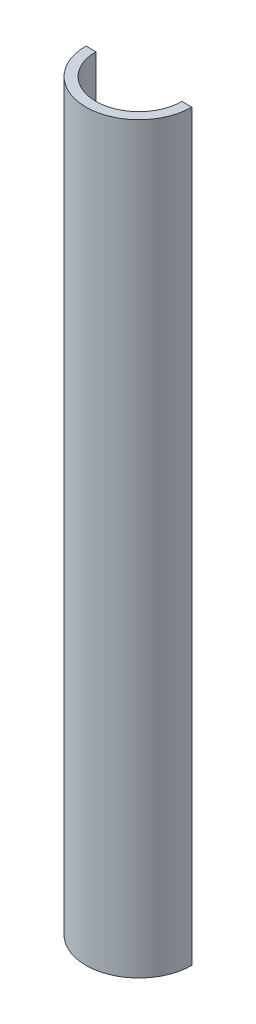
ISO-10303-21;
HEADER;
FILE_DESCRIPTION(('STEP AP214'),'2;1');
FILE_NAME('part.step','',(''),(''),'','','');
FILE_SCHEMA(('AUTOMOTIVE_DESIGN { 1 0 10303 214 1 1 1 1 }'));
ENDSEC;
DATA;
#1=APPLICATION_CONTEXT('core data for automotive mechanical design processes');
#2=APPLICATION_PROTOCOL_DEFINITION('international standard','automotive_design',2000,#1);
#3=PRODUCT_CONTEXT('',#1,'mechanical');
#4=PRODUCT('Part','Part','',(#3));
#5=PRODUCT_RELATED_PRODUCT_CATEGORY('part','',(#4));
#6=PRODUCT_DEFINITION_FORMATION('','',#4);
#7=PRODUCT_DEFINITION_CONTEXT('part definition',#1,'design');
#8=PRODUCT_DEFINITION('design','',#6,#7);
#9=PRODUCT_DEFINITION_SHAPE('','',#8);
#10=(LENGTH_UNIT() NAMED_UNIT(*) SI_UNIT(.MILLI.,.METRE.));
#11=(NAMED_UNIT(*) PLANE_ANGLE_UNIT() SI_UNIT($,.RADIAN.));
#12=(NAMED_UNIT(*) SI_UNIT($,.STERADIAN.) SOLID_ANGLE_UNIT());
#13=UNCERTAINTY_MEASURE_WITH_UNIT(LENGTH_MEASURE(1.E-05),#10,'distance_accuracy_value','');
#14=(GEOMETRIC_REPRESENTATION_CONTEXT(3) GLOBAL_UNCERTAINTY_ASSIGNED_CONTEXT((#13)) GLOBAL_UNIT_ASSIGNED_CONTEXT((#10,
#11,#12)) REPRESENTATION_CONTEXT('',''));
#15=CARTESIAN_POINT('',(0.,0.,0.));
#16=DIRECTION('',(0.,0.,1.));
#17=DIRECTION('',(1.,0.,0.));
#18=AXIS2_PLACEMENT_3D('',#15,#16,#17);
#19=CARTESIAN_POINT('',(0.,300.,0.));
#20=DIRECTION('',(0.,-1.,0.));
#21=DIRECTION('',(0.,0.,-1.));
#22=AXIS2_PLACEMENT_3D('',#19,#20,#21);
#23=CYLINDRICAL_SURFACE('',#22,21.36);
#24=CARTESIAN_POINT('',(0.,300.,0.));
#25=DIRECTION('',(0.,1.,0.));
#26=DIRECTION('',(0.,0.,1.));
#27=AXIS2_PLACEMENT_3D('',#24,#25,#26);
#28=CIRCLE('',#27,21.36);
#29=CARTESIAN_POINT('',(-21.36,300.,0.));
#30=VERTEX_POINT('',#29);
#31=CARTESIAN_POINT('',(21.36,300.,0.));
#32=VERTEX_POINT('',#31);
#33=EDGE_CURVE('E91',#30,#32,#28,.T.);
#34=ORIENTED_EDGE('',*,*,#33,.F.);
#35=DIRECTION('',(0.,-1.,0.));
#36=VECTOR('',#35,1.);
#37=CARTESIAN_POINT('',(-21.36,316.588992616374,0.));
#38=LINE('',#37,#36);
#39=CARTESIAN_POINT('',(-21.36,0.,0.));
#40=VERTEX_POINT('',#39);
#41=EDGE_CURVE('E95',#30,#40,#38,.T.);
#42=ORIENTED_EDGE('',*,*,#41,.T.);
#43=CARTESIAN_POINT('',(0.,0.,0.));
#44=DIRECTION('',(0.,1.,0.));
#45=DIRECTION('',(0.,0.,1.));
#46=AXIS2_PLACEMENT_3D('',#43,#44,#45);
#47=CIRCLE('',#46,21.36);
#48=CARTESIAN_POINT('',(21.36,0.,0.));
#49=VERTEX_POINT('',#48);
#50=EDGE_CURVE('E93',#40,#49,#47,.T.);
#51=ORIENTED_EDGE('',*,*,#50,.T.);
#52=DIRECTION('',(0.,-1.,0.));
#53=VECTOR('',#52,1.);
#54=CARTESIAN_POINT('',(21.36,316.588992616374,0.));
#55=LINE('',#54,#53);
#56=EDGE_CURVE('E79',#32,#49,#55,.T.);
#57=ORIENTED_EDGE('',*,*,#56,.F.);
#58=EDGE_LOOP('',(#34,#42,#51,#57));
#59=FACE_BOUND('',#58,.T.);
#60=ADVANCED_FACE('F38',(#59),#23,.T.);
#61=CARTESIAN_POINT('',(0.,300.,0.));
#62=DIRECTION('',(0.,1.,0.));
#63=DIRECTION('',(0.,0.,1.));
#64=AXIS2_PLACEMENT_3D('',#61,#62,#63);
#65=PLANE('',#64);
#66=DIRECTION('',(1.,0.,0.));
#67=VECTOR('',#66,1.);
#68=CARTESIAN_POINT('',(0.,300.,0.));
#69=LINE('',#68,#67);
#70=CARTESIAN_POINT('',(-17.36,300.,0.));
#71=VERTEX_POINT('',#70);
#72=EDGE_CURVE('E60',#30,#71,#69,.T.);
#73=ORIENTED_EDGE('',*,*,#72,.F.);
#74=ORIENTED_EDGE('',*,*,#33,.T.);
#75=CARTESIAN_POINT('',(17.36,300.,0.));
#76=VERTEX_POINT('',#75);
#77=EDGE_CURVE('E76',#76,#32,#69,.T.);
#78=ORIENTED_EDGE('',*,*,#77,.F.);
#79=CARTESIAN_POINT('',(0.,300.,0.));
#80=DIRECTION('',(0.,1.,0.));
#81=DIRECTION('',(0.,0.,1.));
#82=AXIS2_PLACEMENT_3D('',#79,#80,#81);
#83=CIRCLE('',#82,17.36);
#84=EDGE_CURVE('E102',#71,#76,#83,.T.);
#85=ORIENTED_EDGE('',*,*,#84,.F.);
#86=EDGE_LOOP('',(#73,#74,#78,#85));
#87=FACE_BOUND('',#86,.T.);
#88=ADVANCED_FACE('F97',(#87),#65,.T.);
#89=CARTESIAN_POINT('',(0.,0.,0.));
#90=DIRECTION('',(0.,1.,0.));
#91=DIRECTION('',(0.,0.,1.));
#92=AXIS2_PLACEMENT_3D('',#89,#90,#91);
#93=PLANE('',#92);
#94=ORIENTED_EDGE('',*,*,#50,.F.);
#95=DIRECTION('',(1.,0.,0.));
#96=VECTOR('',#95,1.);
#97=CARTESIAN_POINT('',(0.,0.,0.));
#98=LINE('',#97,#96);
#99=CARTESIAN_POINT('',(-17.36,0.,0.));
#100=VERTEX_POINT('',#99);
#101=EDGE_CURVE('E85',#40,#100,#98,.T.);
#102=ORIENTED_EDGE('',*,*,#101,.T.);
#103=CARTESIAN_POINT('',(0.,0.,0.));
#104=DIRECTION('',(0.,1.,0.));
#105=DIRECTION('',(0.,0.,1.));
#106=AXIS2_PLACEMENT_3D('',#103,#104,#105);
#107=CIRCLE('',#106,17.36);
#108=CARTESIAN_POINT('',(17.36,0.,0.));
#109=VERTEX_POINT('',#108);
#110=EDGE_CURVE('E105',#100,#109,#107,.T.);
#111=ORIENTED_EDGE('',*,*,#110,.T.);
#112=EDGE_CURVE('E53',#109,#49,#98,.T.);
#113=ORIENTED_EDGE('',*,*,#112,.T.);
#114=EDGE_LOOP('',(#94,#102,#111,#113));
#115=FACE_BOUND('',#114,.T.);
#116=ADVANCED_FACE('F116',(#115),#93,.F.);
#117=CARTESIAN_POINT('',(0.,300.,0.));
#118=DIRECTION('',(0.,-1.,0.));
#119=DIRECTION('',(0.,0.,-1.));
#120=AXIS2_PLACEMENT_3D('',#117,#118,#119);
#121=CYLINDRICAL_SURFACE('',#120,17.36);
#122=DIRECTION('',(0.,-1.,0.));
#123=VECTOR('',#122,1.);
#124=CARTESIAN_POINT('',(-17.36,300.,0.));
#125=LINE('',#124,#123);
#126=EDGE_CURVE('E11',#71,#100,#125,.T.);
#127=ORIENTED_EDGE('',*,*,#126,.F.);
#128=ORIENTED_EDGE('',*,*,#84,.T.);
#129=DIRECTION('',(0.,-1.,0.));
#130=VECTOR('',#129,1.);
#131=CARTESIAN_POINT('',(17.36,300.,0.));
#132=LINE('',#131,#130);
#133=EDGE_CURVE('E46',#109,#76,#132,.F.);
#134=ORIENTED_EDGE('',*,*,#133,.F.);
#135=ORIENTED_EDGE('',*,*,#110,.F.);
#136=EDGE_LOOP('',(#127,#128,#134,#135));
#137=FACE_BOUND('',#136,.T.);
#138=ADVANCED_FACE('F119',(#137),#121,.F.);
#139=CARTESIAN_POINT('',(-21.36,316.588992616374,0.));
#140=DIRECTION('',(0.,0.,1.));
#141=DIRECTION('',(1.,0.,0.));
#142=AXIS2_PLACEMENT_3D('',#139,#140,#141);
#143=PLANE('',#142);
#144=ORIENTED_EDGE('',*,*,#77,.T.);
#145=ORIENTED_EDGE('',*,*,#56,.T.);
#146=ORIENTED_EDGE('',*,*,#112,.F.);
#147=ORIENTED_EDGE('',*,*,#133,.T.);
#148=EDGE_LOOP('',(#144,#145,#146,#147));
#149=FACE_BOUND('',#148,.T.);
#150=ADVANCED_FACE('F78',(#149),#143,.F.);
#151=ORIENTED_EDGE('',*,*,#72,.T.);
#152=ORIENTED_EDGE('',*,*,#126,.T.);
#153=ORIENTED_EDGE('',*,*,#101,.F.);
#154=ORIENTED_EDGE('',*,*,#41,.F.);
#155=EDGE_LOOP('',(#151,#152,#153,#154));
#156=FACE_BOUND('',#155,.T.);
#157=ADVANCED_FACE('F120',(#156),#143,.F.);
#158=CLOSED_SHELL('',(#60,#88,#116,#138,#150,#157));
#159=MANIFOLD_SOLID_BREP('B2',#158);
#160=ADVANCED_BREP_SHAPE_REPRESENTATION('',(#18,#159),#14);
#161=SHAPE_DEFINITION_REPRESENTATION(#9,#160);
ENDSEC;
END-ISO-10303-21;
